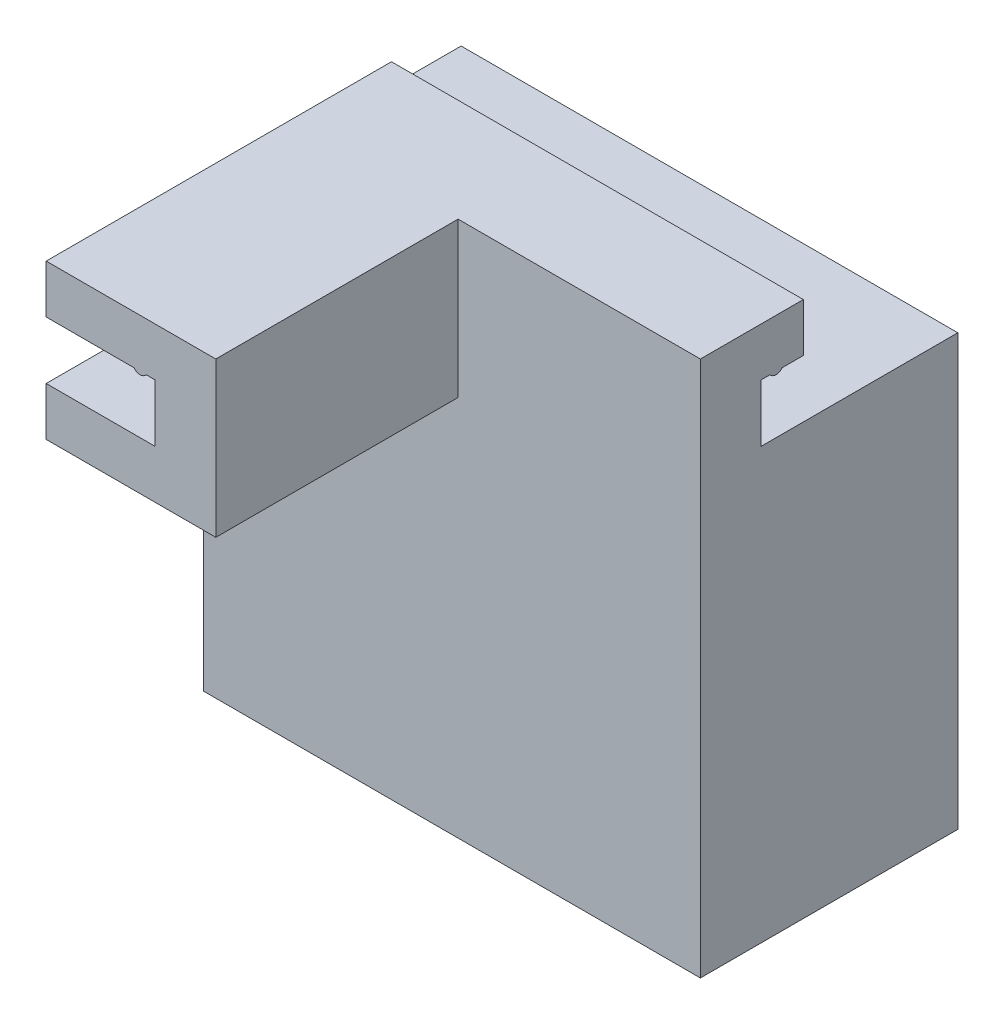
ISO-10303-21;
HEADER;
FILE_DESCRIPTION(('STEP AP214'),'2;1');
FILE_NAME('part.step','',(''),(''),'','','');
FILE_SCHEMA(('AUTOMOTIVE_DESIGN { 1 0 10303 214 1 1 1 1 }'));
ENDSEC;
DATA;
#1=APPLICATION_CONTEXT('core data for automotive mechanical design processes');
#2=APPLICATION_PROTOCOL_DEFINITION('international standard','automotive_design',2000,#1);
#3=PRODUCT_CONTEXT('',#1,'mechanical');
#4=PRODUCT('Part','Part','',(#3));
#5=PRODUCT_RELATED_PRODUCT_CATEGORY('part','',(#4));
#6=PRODUCT_DEFINITION_FORMATION('','',#4);
#7=PRODUCT_DEFINITION_CONTEXT('part definition',#1,'design');
#8=PRODUCT_DEFINITION('design','',#6,#7);
#9=PRODUCT_DEFINITION_SHAPE('','',#8);
#10=(LENGTH_UNIT() NAMED_UNIT(*) SI_UNIT(.MILLI.,.METRE.));
#11=(NAMED_UNIT(*) PLANE_ANGLE_UNIT() SI_UNIT($,.RADIAN.));
#12=(NAMED_UNIT(*) SI_UNIT($,.STERADIAN.) SOLID_ANGLE_UNIT());
#13=UNCERTAINTY_MEASURE_WITH_UNIT(LENGTH_MEASURE(1.E-05),#10,'distance_accuracy_value','');
#14=(GEOMETRIC_REPRESENTATION_CONTEXT(3) GLOBAL_UNCERTAINTY_ASSIGNED_CONTEXT((#13)) GLOBAL_UNIT_ASSIGNED_CONTEXT((#10,
#11,#12)) REPRESENTATION_CONTEXT('',''));
#15=CARTESIAN_POINT('',(0.,0.,0.));
#16=DIRECTION('',(0.,0.,1.));
#17=DIRECTION('',(1.,0.,0.));
#18=AXIS2_PLACEMENT_3D('',#15,#16,#17);
#19=CARTESIAN_POINT('',(0.,0.,0.));
#20=DIRECTION('',(0.,0.,1.));
#21=DIRECTION('',(1.,0.,0.));
#22=AXIS2_PLACEMENT_3D('',#19,#20,#21);
#23=PLANE('',#22);
#24=DIRECTION('',(1.,0.,0.));
#25=VECTOR('',#24,1.);
#26=CARTESIAN_POINT('',(-28.6301458127349,-8.,3.60822483003176E-13));
#27=LINE('',#26,#25);
#28=CARTESIAN_POINT('',(-3.5,-8.,0.));
#29=VERTEX_POINT('',#28);
#30=CARTESIAN_POINT('',(-1.49999999999999,-8.,0.));
#31=VERTEX_POINT('',#30);
#32=EDGE_CURVE('E312',#29,#31,#27,.T.);
#33=ORIENTED_EDGE('',*,*,#32,.T.);
#34=CARTESIAN_POINT('',(-2.5,-7.25,0.));
#35=DIRECTION('',(0.,0.,1.));
#36=DIRECTION('',(1.,0.,0.));
#37=AXIS2_PLACEMENT_3D('',#34,#35,#36);
#38=CIRCLE('',#37,1.25);
#39=EDGE_CURVE('E156',#29,#31,#38,.T.);
#40=ORIENTED_EDGE('',*,*,#39,.F.);
#41=EDGE_LOOP('',(#33,#40));
#42=FACE_BOUND('',#41,.T.);
#43=ADVANCED_FACE('F45',(#42),#23,.F.);
#44=CARTESIAN_POINT('',(0.,0.,0.));
#45=DIRECTION('',(1.,0.,0.));
#46=DIRECTION('',(0.,0.,-1.));
#47=AXIS2_PLACEMENT_3D('',#44,#45,#46);
#48=PLANE('',#47);
#49=DIRECTION('',(0.,0.,1.));
#50=VECTOR('',#49,1.);
#51=CARTESIAN_POINT('',(0.,-8.,0.));
#52=LINE('',#51,#50);
#53=CARTESIAN_POINT('',(0.,-8.,-3.49999999999999));
#54=VERTEX_POINT('',#53);
#55=CARTESIAN_POINT('',(0.,-8.,-1.50000000000001));
#56=VERTEX_POINT('',#55);
#57=EDGE_CURVE('E315',#54,#56,#52,.T.);
#58=ORIENTED_EDGE('',*,*,#57,.F.);
#59=CARTESIAN_POINT('',(0.,-7.24999999999968,-2.5));
#60=DIRECTION('',(1.,0.,0.));
#61=DIRECTION('',(0.,0.,-1.));
#62=AXIS2_PLACEMENT_3D('',#59,#60,#61);
#63=CIRCLE('',#62,1.25000000000018);
#64=EDGE_CURVE('E245',#54,#56,#63,.F.);
#65=ORIENTED_EDGE('',*,*,#64,.T.);
#66=EDGE_LOOP('',(#58,#65));
#67=FACE_BOUND('',#66,.T.);
#68=ADVANCED_FACE('F404',(#67),#48,.F.);
#69=CARTESIAN_POINT('',(-2.5,-7.25,50.));
#70=DIRECTION('',(0.,0.,-1.));
#71=DIRECTION('',(-1.,0.,0.));
#72=AXIS2_PLACEMENT_3D('',#69,#70,#71);
#73=CYLINDRICAL_SURFACE('',#72,1.25);
#74=ORIENTED_EDGE('',*,*,#39,.T.);
#75=DIRECTION('',(0.,0.,-1.));
#76=VECTOR('',#75,1.);
#77=CARTESIAN_POINT('',(-1.49999999999999,-8.,50.));
#78=LINE('',#77,#76);
#79=CARTESIAN_POINT('',(-1.49999999999999,-8.,50.));
#80=VERTEX_POINT('',#79);
#81=EDGE_CURVE('E187',#80,#31,#78,.T.);
#82=ORIENTED_EDGE('',*,*,#81,.F.);
#83=CARTESIAN_POINT('',(-2.5,-7.25,50.));
#84=DIRECTION('',(0.,0.,1.));
#85=DIRECTION('',(1.,0.,0.));
#86=AXIS2_PLACEMENT_3D('',#83,#84,#85);
#87=CIRCLE('',#86,1.25);
#88=CARTESIAN_POINT('',(-3.5,-8.,50.));
#89=VERTEX_POINT('',#88);
#90=EDGE_CURVE('E163',#89,#80,#87,.T.);
#91=ORIENTED_EDGE('',*,*,#90,.F.);
#92=DIRECTION('',(0.,0.,-1.));
#93=VECTOR('',#92,1.);
#94=CARTESIAN_POINT('',(-3.5,-8.,50.));
#95=LINE('',#94,#93);
#96=EDGE_CURVE('E91',#89,#29,#95,.T.);
#97=ORIENTED_EDGE('',*,*,#96,.T.);
#98=EDGE_LOOP('',(#74,#82,#91,#97));
#99=FACE_BOUND('',#98,.T.);
#100=ADVANCED_FACE('F47',(#99),#73,.T.);
#101=CARTESIAN_POINT('',(0.,0.,50.));
#102=DIRECTION('',(1.,0.,0.));
#103=DIRECTION('',(0.,1.,0.));
#104=AXIS2_PLACEMENT_3D('',#101,#102,#103);
#105=PLANE('',#104);
#106=DIRECTION('',(0.,0.,-1.));
#107=VECTOR('',#106,1.);
#108=CARTESIAN_POINT('',(0.,-8.,50.));
#109=LINE('',#108,#107);
#110=CARTESIAN_POINT('',(0.,-8.,50.));
#111=VERTEX_POINT('',#110);
#112=CARTESIAN_POINT('',(0.,-8.,0.));
#113=VERTEX_POINT('',#112);
#114=EDGE_CURVE('E184',#111,#113,#109,.T.);
#115=ORIENTED_EDGE('',*,*,#114,.T.);
#116=DIRECTION('',(0.,-1.,0.));
#117=VECTOR('',#116,1.);
#118=CARTESIAN_POINT('',(0.,0.,0.));
#119=LINE('',#118,#117);
#120=CARTESIAN_POINT('',(0.,-17.5,0.));
#121=VERTEX_POINT('',#120);
#122=EDGE_CURVE('E159',#113,#121,#119,.T.);
#123=ORIENTED_EDGE('',*,*,#122,.T.);
#124=DIRECTION('',(0.,0.,-1.));
#125=VECTOR('',#124,1.);
#126=CARTESIAN_POINT('',(0.,-17.5,50.));
#127=LINE('',#126,#125);
#128=CARTESIAN_POINT('',(0.,-17.5,50.));
#129=VERTEX_POINT('',#128);
#130=EDGE_CURVE('E181',#129,#121,#127,.T.);
#131=ORIENTED_EDGE('',*,*,#130,.F.);
#132=DIRECTION('',(0.,-1.,0.));
#133=VECTOR('',#132,1.);
#134=CARTESIAN_POINT('',(0.,0.,50.));
#135=LINE('',#134,#133);
#136=EDGE_CURVE('E267',#111,#129,#135,.T.);
#137=ORIENTED_EDGE('',*,*,#136,.F.);
#138=EDGE_LOOP('',(#115,#123,#131,#137));
#139=FACE_BOUND('',#138,.T.);
#140=ADVANCED_FACE('F448',(#139),#105,.F.);
#141=CARTESIAN_POINT('',(0.,-17.5,50.));
#142=DIRECTION('',(0.,-1.,0.));
#143=DIRECTION('',(1.,0.,0.));
#144=AXIS2_PLACEMENT_3D('',#141,#142,#143);
#145=PLANE('',#144);
#146=ORIENTED_EDGE('',*,*,#130,.T.);
#147=DIRECTION('',(-1.,0.,0.));
#148=VECTOR('',#147,1.);
#149=CARTESIAN_POINT('',(0.,-17.5,0.));
#150=LINE('',#149,#148);
#151=CARTESIAN_POINT('',(50.,-17.5,0.));
#152=VERTEX_POINT('',#151);
#153=EDGE_CURVE('E11',#152,#121,#150,.T.);
#154=ORIENTED_EDGE('',*,*,#153,.F.);
#155=DIRECTION('',(0.,0.,-1.));
#156=VECTOR('',#155,1.);
#157=CARTESIAN_POINT('',(50.,-17.5,0.));
#158=LINE('',#157,#156);
#159=CARTESIAN_POINT('',(50.,-17.5,-32.5));
#160=VERTEX_POINT('',#159);
#161=EDGE_CURVE('E213',#152,#160,#158,.T.);
#162=ORIENTED_EDGE('',*,*,#161,.T.);
#163=DIRECTION('',(1.,0.,0.));
#164=VECTOR('',#163,1.);
#165=CARTESIAN_POINT('',(-114.748111760934,-17.5,-32.5));
#166=LINE('',#165,#164);
#167=CARTESIAN_POINT('',(-32.,-17.5,-32.5));
#168=VERTEX_POINT('',#167);
#169=EDGE_CURVE('E339',#168,#160,#166,.T.);
#170=ORIENTED_EDGE('',*,*,#169,.F.);
#171=DIRECTION('',(0.,0.,-1.));
#172=VECTOR('',#171,1.);
#173=CARTESIAN_POINT('',(-32.,-17.5,0.));
#174=LINE('',#173,#172);
#175=CARTESIAN_POINT('',(-32.,-17.5,10.0000000000001));
#176=VERTEX_POINT('',#175);
#177=EDGE_CURVE('E351',#176,#168,#174,.T.);
#178=ORIENTED_EDGE('',*,*,#177,.F.);
#179=DIRECTION('',(1.,0.,0.));
#180=VECTOR('',#179,1.);
#181=CARTESIAN_POINT('',(-114.748111760934,-17.5,10.0000000000001));
#182=LINE('',#181,#180);
#183=CARTESIAN_POINT('',(-18.,-17.5,10.0000000000001));
#184=VERTEX_POINT('',#183);
#185=EDGE_CURVE('E326',#176,#184,#182,.T.);
#186=ORIENTED_EDGE('',*,*,#185,.T.);
#187=DIRECTION('',(0.,0.,-1.));
#188=VECTOR('',#187,1.);
#189=CARTESIAN_POINT('',(-18.,-17.5,50.));
#190=LINE('',#189,#188);
#191=CARTESIAN_POINT('',(-18.,-17.5,50.));
#192=VERTEX_POINT('',#191);
#193=EDGE_CURVE('E177',#192,#184,#190,.T.);
#194=ORIENTED_EDGE('',*,*,#193,.F.);
#195=DIRECTION('',(-1.,0.,0.));
#196=VECTOR('',#195,1.);
#197=CARTESIAN_POINT('',(0.,-17.5,50.));
#198=LINE('',#197,#196);
#199=EDGE_CURVE('E270',#129,#192,#198,.T.);
#200=ORIENTED_EDGE('',*,*,#199,.F.);
#201=EDGE_LOOP('',(#146,#154,#162,#170,#178,#186,#194,#200));
#202=FACE_BOUND('',#201,.T.);
#203=ADVANCED_FACE('F445',(#202),#145,.F.);
#204=CARTESIAN_POINT('',(-18.,0.,50.));
#205=DIRECTION('',(1.,0.,0.));
#206=DIRECTION('',(0.,1.,0.));
#207=AXIS2_PLACEMENT_3D('',#204,#205,#206);
#208=PLANE('',#207);
#209=ORIENTED_EDGE('',*,*,#193,.T.);
#210=DIRECTION('',(0.,-1.,0.));
#211=VECTOR('',#210,1.);
#212=CARTESIAN_POINT('',(-18.,0.,10.0000000000001));
#213=LINE('',#212,#211);
#214=CARTESIAN_POINT('',(-18.,-25.5,10.0000000000001));
#215=VERTEX_POINT('',#214);
#216=EDGE_CURVE('E318',#184,#215,#213,.T.);
#217=ORIENTED_EDGE('',*,*,#216,.T.);
#218=DIRECTION('',(0.,0.,-1.));
#219=VECTOR('',#218,1.);
#220=CARTESIAN_POINT('',(-18.,-25.5,50.));
#221=LINE('',#220,#219);
#222=CARTESIAN_POINT('',(-18.,-25.5,50.));
#223=VERTEX_POINT('',#222);
#224=EDGE_CURVE('E173',#223,#215,#221,.T.);
#225=ORIENTED_EDGE('',*,*,#224,.F.);
#226=DIRECTION('',(0.,-1.,0.));
#227=VECTOR('',#226,1.);
#228=CARTESIAN_POINT('',(-18.,0.,50.));
#229=LINE('',#228,#227);
#230=EDGE_CURVE('E273',#192,#223,#229,.T.);
#231=ORIENTED_EDGE('',*,*,#230,.F.);
#232=EDGE_LOOP('',(#209,#217,#225,#231));
#233=FACE_BOUND('',#232,.T.);
#234=ADVANCED_FACE('F442',(#233),#208,.F.);
#235=CARTESIAN_POINT('',(0.,-25.5,50.));
#236=DIRECTION('',(0.,1.,0.));
#237=DIRECTION('',(-1.,0.,0.));
#238=AXIS2_PLACEMENT_3D('',#235,#236,#237);
#239=PLANE('',#238);
#240=ORIENTED_EDGE('',*,*,#224,.T.);
#241=DIRECTION('',(1.,0.,0.));
#242=VECTOR('',#241,1.);
#243=CARTESIAN_POINT('',(0.,-25.5,10.0000000000001));
#244=LINE('',#243,#242);
#245=CARTESIAN_POINT('',(10.,-25.5,10.0000000000001));
#246=VERTEX_POINT('',#245);
#247=EDGE_CURVE('E288',#215,#246,#244,.T.);
#248=ORIENTED_EDGE('',*,*,#247,.T.);
#249=DIRECTION('',(0.,0.,-1.));
#250=VECTOR('',#249,1.);
#251=CARTESIAN_POINT('',(10.,-25.5,50.));
#252=LINE('',#251,#250);
#253=CARTESIAN_POINT('',(10.,-25.5,50.));
#254=VERTEX_POINT('',#253);
#255=EDGE_CURVE('E170',#254,#246,#252,.T.);
#256=ORIENTED_EDGE('',*,*,#255,.F.);
#257=DIRECTION('',(1.,0.,0.));
#258=VECTOR('',#257,1.);
#259=CARTESIAN_POINT('',(0.,-25.5,50.));
#260=LINE('',#259,#258);
#261=EDGE_CURVE('E276',#223,#254,#260,.T.);
#262=ORIENTED_EDGE('',*,*,#261,.F.);
#263=EDGE_LOOP('',(#240,#248,#256,#262));
#264=FACE_BOUND('',#263,.T.);
#265=ADVANCED_FACE('F285',(#264),#239,.F.);
#266=CARTESIAN_POINT('',(10.,0.,50.));
#267=DIRECTION('',(-1.,0.,0.));
#268=DIRECTION('',(0.,-1.,0.));
#269=AXIS2_PLACEMENT_3D('',#266,#267,#268);
#270=PLANE('',#269);
#271=ORIENTED_EDGE('',*,*,#255,.T.);
#272=DIRECTION('',(0.,1.,0.));
#273=VECTOR('',#272,1.);
#274=CARTESIAN_POINT('',(10.,5.80282009807138E-13,10.0000000000004));
#275=LINE('',#274,#273);
#276=CARTESIAN_POINT('',(10.,0.,10.0000000000004));
#277=VERTEX_POINT('',#276);
#278=EDGE_CURVE('E61',#246,#277,#275,.T.);
#279=ORIENTED_EDGE('',*,*,#278,.T.);
#280=DIRECTION('',(0.,0.,-1.));
#281=VECTOR('',#280,1.);
#282=CARTESIAN_POINT('',(10.,0.,50.));
#283=LINE('',#282,#281);
#284=CARTESIAN_POINT('',(10.,0.,50.));
#285=VERTEX_POINT('',#284);
#286=EDGE_CURVE('E145',#285,#277,#283,.T.);
#287=ORIENTED_EDGE('',*,*,#286,.F.);
#288=DIRECTION('',(0.,1.,0.));
#289=VECTOR('',#288,1.);
#290=CARTESIAN_POINT('',(10.,0.,50.));
#291=LINE('',#290,#289);
#292=EDGE_CURVE('E129',#254,#285,#291,.T.);
#293=ORIENTED_EDGE('',*,*,#292,.F.);
#294=EDGE_LOOP('',(#271,#279,#287,#293));
#295=FACE_BOUND('',#294,.T.);
#296=ADVANCED_FACE('F289',(#295),#270,.F.);
#297=CARTESIAN_POINT('',(0.,0.,50.));
#298=DIRECTION('',(0.,-1.,0.));
#299=DIRECTION('',(1.,0.,0.));
#300=AXIS2_PLACEMENT_3D('',#297,#298,#299);
#301=PLANE('',#300);
#302=DIRECTION('',(-1.,0.,0.));
#303=VECTOR('',#302,1.);
#304=CARTESIAN_POINT('',(50.,0.,-7.));
#305=LINE('',#304,#303);
#306=CARTESIAN_POINT('',(50.,0.,-7.));
#307=VERTEX_POINT('',#306);
#308=CARTESIAN_POINT('',(-18.,0.,-7.));
#309=VERTEX_POINT('',#308);
#310=EDGE_CURVE('E140',#307,#309,#305,.T.);
#311=ORIENTED_EDGE('',*,*,#310,.T.);
#312=DIRECTION('',(0.,0.,-1.));
#313=VECTOR('',#312,1.);
#314=CARTESIAN_POINT('',(-18.,0.,50.));
#315=LINE('',#314,#313);
#316=CARTESIAN_POINT('',(-18.,0.,50.));
#317=VERTEX_POINT('',#316);
#318=EDGE_CURVE('E135',#317,#309,#315,.T.);
#319=ORIENTED_EDGE('',*,*,#318,.F.);
#320=DIRECTION('',(-1.,0.,0.));
#321=VECTOR('',#320,1.);
#322=CARTESIAN_POINT('',(0.,0.,50.));
#323=LINE('',#322,#321);
#324=EDGE_CURVE('E122',#285,#317,#323,.T.);
#325=ORIENTED_EDGE('',*,*,#324,.F.);
#326=ORIENTED_EDGE('',*,*,#286,.T.);
#327=DIRECTION('',(-1.,0.,0.));
#328=VECTOR('',#327,1.);
#329=CARTESIAN_POINT('',(50.,0.,10.0000000000004));
#330=LINE('',#329,#328);
#331=CARTESIAN_POINT('',(50.,0.,10.0000000000004));
#332=VERTEX_POINT('',#331);
#333=EDGE_CURVE('E258',#332,#277,#330,.T.);
#334=ORIENTED_EDGE('',*,*,#333,.F.);
#335=DIRECTION('',(0.,0.,-1.));
#336=VECTOR('',#335,1.);
#337=CARTESIAN_POINT('',(50.,0.,0.));
#338=LINE('',#337,#336);
#339=EDGE_CURVE('E248',#332,#307,#338,.T.);
#340=ORIENTED_EDGE('',*,*,#339,.T.);
#341=EDGE_LOOP('',(#311,#319,#325,#326,#334,#340));
#342=FACE_BOUND('',#341,.T.);
#343=ADVANCED_FACE('F136',(#342),#301,.F.);
#344=CARTESIAN_POINT('',(-18.,0.,50.));
#345=DIRECTION('',(1.,0.,0.));
#346=DIRECTION('',(0.,1.,0.));
#347=AXIS2_PLACEMENT_3D('',#344,#345,#346);
#348=PLANE('',#347);
#349=ORIENTED_EDGE('',*,*,#318,.T.);
#350=DIRECTION('',(0.,1.,0.));
#351=VECTOR('',#350,1.);
#352=CARTESIAN_POINT('',(-18.,0.,-7.));
#353=LINE('',#352,#351);
#354=CARTESIAN_POINT('',(-18.,-8.,-7.));
#355=VERTEX_POINT('',#354);
#356=EDGE_CURVE('E249',#355,#309,#353,.T.);
#357=ORIENTED_EDGE('',*,*,#356,.F.);
#358=DIRECTION('',(0.,0.,-1.));
#359=VECTOR('',#358,1.);
#360=CARTESIAN_POINT('',(-18.,-8.,50.));
#361=LINE('',#360,#359);
#362=CARTESIAN_POINT('',(-18.,-8.,50.));
#363=VERTEX_POINT('',#362);
#364=EDGE_CURVE('E146',#363,#355,#361,.T.);
#365=ORIENTED_EDGE('',*,*,#364,.F.);
#366=DIRECTION('',(0.,-1.,0.));
#367=VECTOR('',#366,1.);
#368=CARTESIAN_POINT('',(-18.,0.,50.));
#369=LINE('',#368,#367);
#370=EDGE_CURVE('E126',#317,#363,#369,.T.);
#371=ORIENTED_EDGE('',*,*,#370,.F.);
#372=EDGE_LOOP('',(#349,#357,#365,#371));
#373=FACE_BOUND('',#372,.T.);
#374=ADVANCED_FACE('F148',(#373),#348,.F.);
#375=CARTESIAN_POINT('',(0.,-8.,50.));
#376=DIRECTION('',(0.,1.,0.));
#377=DIRECTION('',(-1.,0.,0.));
#378=AXIS2_PLACEMENT_3D('',#375,#376,#377);
#379=PLANE('',#378);
#380=ORIENTED_EDGE('',*,*,#364,.T.);
#381=DIRECTION('',(-1.,0.,0.));
#382=VECTOR('',#381,1.);
#383=CARTESIAN_POINT('',(50.,-8.,-7.));
#384=LINE('',#383,#382);
#385=CARTESIAN_POINT('',(50.,-8.,-7.));
#386=VERTEX_POINT('',#385);
#387=EDGE_CURVE('E242',#386,#355,#384,.T.);
#388=ORIENTED_EDGE('',*,*,#387,.F.);
#389=DIRECTION('',(0.,0.,1.));
#390=VECTOR('',#389,1.);
#391=CARTESIAN_POINT('',(50.,-8.,0.));
#392=LINE('',#391,#390);
#393=CARTESIAN_POINT('',(50.,-8.,-3.49999999999999));
#394=VERTEX_POINT('',#393);
#395=EDGE_CURVE('E224',#386,#394,#392,.T.);
#396=ORIENTED_EDGE('',*,*,#395,.T.);
#397=DIRECTION('',(-1.,0.,0.));
#398=VECTOR('',#397,1.);
#399=CARTESIAN_POINT('',(50.,-8.,-3.49999999999999));
#400=LINE('',#399,#398);
#401=EDGE_CURVE('E253',#394,#54,#400,.T.);
#402=ORIENTED_EDGE('',*,*,#401,.T.);
#403=ORIENTED_EDGE('',*,*,#57,.T.);
#404=DIRECTION('',(-1.,0.,0.));
#405=VECTOR('',#404,1.);
#406=CARTESIAN_POINT('',(50.,-8.,-1.50000000000001));
#407=LINE('',#406,#405);
#408=CARTESIAN_POINT('',(50.,-8.,-1.50000000000001));
#409=VERTEX_POINT('',#408);
#410=EDGE_CURVE('E220',#409,#56,#407,.T.);
#411=ORIENTED_EDGE('',*,*,#410,.F.);
#412=CARTESIAN_POINT('',(50.,-8.,1.79921382781929E-13));
#413=VERTEX_POINT('',#412);
#414=EDGE_CURVE('E209',#409,#413,#392,.T.);
#415=ORIENTED_EDGE('',*,*,#414,.T.);
#416=DIRECTION('',(1.,0.,0.));
#417=VECTOR('',#416,1.);
#418=CARTESIAN_POINT('',(0.,-8.,0.));
#419=LINE('',#418,#417);
#420=EDGE_CURVE('E54',#113,#413,#419,.T.);
#421=ORIENTED_EDGE('',*,*,#420,.F.);
#422=ORIENTED_EDGE('',*,*,#114,.F.);
#423=DIRECTION('',(1.,0.,0.));
#424=VECTOR('',#423,1.);
#425=CARTESIAN_POINT('',(0.,-8.,50.));
#426=LINE('',#425,#424);
#427=EDGE_CURVE('E100',#80,#111,#426,.T.);
#428=ORIENTED_EDGE('',*,*,#427,.F.);
#429=ORIENTED_EDGE('',*,*,#81,.T.);
#430=ORIENTED_EDGE('',*,*,#32,.F.);
#431=ORIENTED_EDGE('',*,*,#96,.F.);
#432=EDGE_CURVE('E70',#363,#89,#426,.T.);
#433=ORIENTED_EDGE('',*,*,#432,.F.);
#434=EDGE_LOOP('',(#380,#388,#396,#402,#403,#411,#415,#421,#422,#428,#429,#430,#431,#433));
#435=FACE_BOUND('',#434,.T.);
#436=ADVANCED_FACE('F217',(#435),#379,.F.);
#437=CARTESIAN_POINT('',(0.,0.,50.));
#438=DIRECTION('',(0.,0.,1.));
#439=DIRECTION('',(1.,0.,0.));
#440=AXIS2_PLACEMENT_3D('',#437,#438,#439);
#441=PLANE('',#440);
#442=ORIENTED_EDGE('',*,*,#90,.T.);
#443=ORIENTED_EDGE('',*,*,#427,.T.);
#444=ORIENTED_EDGE('',*,*,#136,.T.);
#445=ORIENTED_EDGE('',*,*,#199,.T.);
#446=ORIENTED_EDGE('',*,*,#230,.T.);
#447=ORIENTED_EDGE('',*,*,#261,.T.);
#448=ORIENTED_EDGE('',*,*,#292,.T.);
#449=ORIENTED_EDGE('',*,*,#324,.T.);
#450=ORIENTED_EDGE('',*,*,#370,.T.);
#451=ORIENTED_EDGE('',*,*,#432,.T.);
#452=EDGE_LOOP('',(#442,#443,#444,#445,#446,#447,#448,#449,#450,#451));
#453=FACE_BOUND('',#452,.T.);
#454=ADVANCED_FACE('F124',(#453),#441,.T.);
#455=ORIENTED_EDGE('',*,*,#420,.T.);
#456=DIRECTION('',(0.,-1.,0.));
#457=VECTOR('',#456,1.);
#458=CARTESIAN_POINT('',(50.,0.,0.));
#459=LINE('',#458,#457);
#460=EDGE_CURVE('E199',#413,#152,#459,.T.);
#461=ORIENTED_EDGE('',*,*,#460,.T.);
#462=ORIENTED_EDGE('',*,*,#153,.T.);
#463=ORIENTED_EDGE('',*,*,#122,.F.);
#464=EDGE_LOOP('',(#455,#461,#462,#463));
#465=FACE_BOUND('',#464,.T.);
#466=ADVANCED_FACE('F197',(#465),#23,.F.);
#467=CARTESIAN_POINT('',(50.,-1.44900431522774E-13,10.0000000000004));
#468=DIRECTION('',(0.,0.,1.));
#469=DIRECTION('',(0.,-1.,0.));
#470=AXIS2_PLACEMENT_3D('',#467,#468,#469);
#471=PLANE('',#470);
#472=DIRECTION('',(0.,1.,0.));
#473=VECTOR('',#472,1.);
#474=CARTESIAN_POINT('',(50.,-1.44900431522774E-13,10.0000000000004));
#475=LINE('',#474,#473);
#476=CARTESIAN_POINT('',(50.,-88.5,10.0000000000001));
#477=VERTEX_POINT('',#476);
#478=EDGE_CURVE('E297',#477,#332,#475,.T.);
#479=ORIENTED_EDGE('',*,*,#478,.T.);
#480=ORIENTED_EDGE('',*,*,#333,.T.);
#481=ORIENTED_EDGE('',*,*,#278,.F.);
#482=ORIENTED_EDGE('',*,*,#247,.F.);
#483=ORIENTED_EDGE('',*,*,#216,.F.);
#484=ORIENTED_EDGE('',*,*,#185,.F.);
#485=DIRECTION('',(0.,-1.,0.));
#486=VECTOR('',#485,1.);
#487=CARTESIAN_POINT('',(-32.,0.,10.0000000000001));
#488=LINE('',#487,#486);
#489=CARTESIAN_POINT('',(-32.,-88.5,10.0000000000001));
#490=VERTEX_POINT('',#489);
#491=EDGE_CURVE('E334',#176,#490,#488,.T.);
#492=ORIENTED_EDGE('',*,*,#491,.T.);
#493=DIRECTION('',(1.,0.,0.));
#494=VECTOR('',#493,1.);
#495=CARTESIAN_POINT('',(-114.748111760934,-88.5,10.0000000000001));
#496=LINE('',#495,#494);
#497=EDGE_CURVE('E301',#490,#477,#496,.T.);
#498=ORIENTED_EDGE('',*,*,#497,.T.);
#499=EDGE_LOOP('',(#479,#480,#481,#482,#483,#484,#492,#498));
#500=FACE_BOUND('',#499,.T.);
#501=ADVANCED_FACE('F295',(#500),#471,.T.);
#502=CARTESIAN_POINT('',(50.,-7.24999999999968,-2.5));
#503=DIRECTION('',(-1.,0.,0.));
#504=DIRECTION('',(0.,0.,1.));
#505=AXIS2_PLACEMENT_3D('',#502,#503,#504);
#506=CYLINDRICAL_SURFACE('',#505,1.25000000000018);
#507=ORIENTED_EDGE('',*,*,#64,.F.);
#508=ORIENTED_EDGE('',*,*,#401,.F.);
#509=CARTESIAN_POINT('',(50.,-7.24999999999968,-2.5));
#510=DIRECTION('',(1.,0.,0.));
#511=DIRECTION('',(0.,0.,-1.));
#512=AXIS2_PLACEMENT_3D('',#509,#510,#511);
#513=CIRCLE('',#512,1.25000000000018);
#514=EDGE_CURVE('E222',#394,#409,#513,.F.);
#515=ORIENTED_EDGE('',*,*,#514,.T.);
#516=ORIENTED_EDGE('',*,*,#410,.T.);
#517=EDGE_LOOP('',(#507,#508,#515,#516));
#518=FACE_BOUND('',#517,.T.);
#519=ADVANCED_FACE('F405',(#518),#506,.T.);
#520=CARTESIAN_POINT('',(50.,0.,-7.));
#521=DIRECTION('',(0.,0.,-1.));
#522=DIRECTION('',(0.,1.,0.));
#523=AXIS2_PLACEMENT_3D('',#520,#521,#522);
#524=PLANE('',#523);
#525=ORIENTED_EDGE('',*,*,#387,.T.);
#526=ORIENTED_EDGE('',*,*,#356,.T.);
#527=ORIENTED_EDGE('',*,*,#310,.F.);
#528=DIRECTION('',(0.,-1.,0.));
#529=VECTOR('',#528,1.);
#530=CARTESIAN_POINT('',(50.,0.,-7.));
#531=LINE('',#530,#529);
#532=EDGE_CURVE('E229',#307,#386,#531,.T.);
#533=ORIENTED_EDGE('',*,*,#532,.T.);
#534=EDGE_LOOP('',(#525,#526,#527,#533));
#535=FACE_BOUND('',#534,.T.);
#536=ADVANCED_FACE('F407',(#535),#524,.T.);
#537=CARTESIAN_POINT('',(50.,0.,0.));
#538=DIRECTION('',(1.,0.,0.));
#539=DIRECTION('',(0.,0.,-1.));
#540=AXIS2_PLACEMENT_3D('',#537,#538,#539);
#541=PLANE('',#540);
#542=ORIENTED_EDGE('',*,*,#478,.F.);
#543=DIRECTION('',(0.,0.,1.));
#544=VECTOR('',#543,1.);
#545=CARTESIAN_POINT('',(50.,-88.5,0.));
#546=LINE('',#545,#544);
#547=CARTESIAN_POINT('',(50.,-88.5,-32.5));
#548=VERTEX_POINT('',#547);
#549=EDGE_CURVE('E338',#548,#477,#546,.T.);
#550=ORIENTED_EDGE('',*,*,#549,.F.);
#551=DIRECTION('',(0.,-1.,0.));
#552=VECTOR('',#551,1.);
#553=CARTESIAN_POINT('',(50.,0.,-32.5));
#554=LINE('',#553,#552);
#555=EDGE_CURVE('E330',#160,#548,#554,.T.);
#556=ORIENTED_EDGE('',*,*,#555,.F.);
#557=ORIENTED_EDGE('',*,*,#161,.F.);
#558=ORIENTED_EDGE('',*,*,#460,.F.);
#559=ORIENTED_EDGE('',*,*,#414,.F.);
#560=ORIENTED_EDGE('',*,*,#514,.F.);
#561=ORIENTED_EDGE('',*,*,#395,.F.);
#562=ORIENTED_EDGE('',*,*,#532,.F.);
#563=ORIENTED_EDGE('',*,*,#339,.F.);
#564=EDGE_LOOP('',(#542,#550,#556,#557,#558,#559,#560,#561,#562,#563));
#565=FACE_BOUND('',#564,.T.);
#566=ADVANCED_FACE('F207',(#565),#541,.T.);
#567=CARTESIAN_POINT('',(-32.,0.,0.));
#568=DIRECTION('',(-1.,0.,0.));
#569=DIRECTION('',(0.,-1.,0.));
#570=AXIS2_PLACEMENT_3D('',#567,#568,#569);
#571=PLANE('',#570);
#572=ORIENTED_EDGE('',*,*,#491,.F.);
#573=ORIENTED_EDGE('',*,*,#177,.T.);
#574=DIRECTION('',(0.,-1.,0.));
#575=VECTOR('',#574,1.);
#576=CARTESIAN_POINT('',(-32.,0.,-32.5));
#577=LINE('',#576,#575);
#578=CARTESIAN_POINT('',(-32.,-88.5,-32.5));
#579=VERTEX_POINT('',#578);
#580=EDGE_CURVE('E347',#168,#579,#577,.T.);
#581=ORIENTED_EDGE('',*,*,#580,.T.);
#582=DIRECTION('',(0.,0.,1.));
#583=VECTOR('',#582,1.);
#584=CARTESIAN_POINT('',(-32.,-88.5,0.));
#585=LINE('',#584,#583);
#586=EDGE_CURVE('E343',#579,#490,#585,.T.);
#587=ORIENTED_EDGE('',*,*,#586,.T.);
#588=EDGE_LOOP('',(#572,#573,#581,#587));
#589=FACE_BOUND('',#588,.T.);
#590=ADVANCED_FACE('F466',(#589),#571,.T.);
#591=CARTESIAN_POINT('',(-114.748111760934,-88.5,0.));
#592=DIRECTION('',(0.,1.,0.));
#593=DIRECTION('',(0.,0.,1.));
#594=AXIS2_PLACEMENT_3D('',#591,#592,#593);
#595=PLANE('',#594);
#596=ORIENTED_EDGE('',*,*,#586,.F.);
#597=DIRECTION('',(1.,0.,0.));
#598=VECTOR('',#597,1.);
#599=CARTESIAN_POINT('',(-114.748111760934,-88.5,-32.5));
#600=LINE('',#599,#598);
#601=EDGE_CURVE('E333',#579,#548,#600,.T.);
#602=ORIENTED_EDGE('',*,*,#601,.T.);
#603=ORIENTED_EDGE('',*,*,#549,.T.);
#604=ORIENTED_EDGE('',*,*,#497,.F.);
#605=EDGE_LOOP('',(#596,#602,#603,#604));
#606=FACE_BOUND('',#605,.T.);
#607=ADVANCED_FACE('F372',(#606),#595,.F.);
#608=CARTESIAN_POINT('',(-114.748111760934,0.,-32.5));
#609=DIRECTION('',(0.,0.,1.));
#610=DIRECTION('',(1.,0.,0.));
#611=AXIS2_PLACEMENT_3D('',#608,#609,#610);
#612=PLANE('',#611);
#613=ORIENTED_EDGE('',*,*,#580,.F.);
#614=ORIENTED_EDGE('',*,*,#169,.T.);
#615=ORIENTED_EDGE('',*,*,#555,.T.);
#616=ORIENTED_EDGE('',*,*,#601,.F.);
#617=EDGE_LOOP('',(#613,#614,#615,#616));
#618=FACE_BOUND('',#617,.T.);
#619=ADVANCED_FACE('F365',(#618),#612,.F.);
#620=CLOSED_SHELL('',(#43,#68,#100,#140,#203,#234,#265,#296,#343,#374,#436,#454,#466,#501,#519,
#536,#566,#590,#607,#619));
#621=MANIFOLD_SOLID_BREP('B2',#620);
#622=ADVANCED_BREP_SHAPE_REPRESENTATION('',(#18,#621),#14);
#623=SHAPE_DEFINITION_REPRESENTATION(#9,#622);
ENDSEC;
END-ISO-10303-21;
